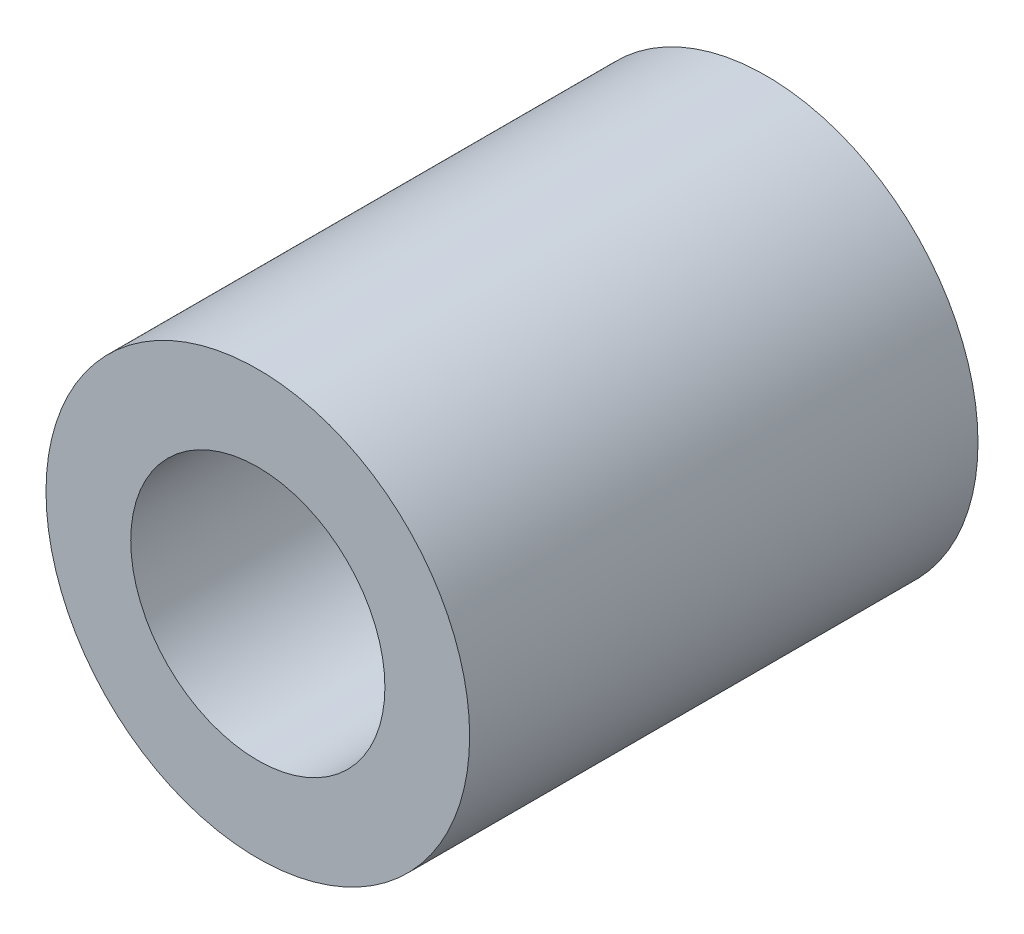
ISO-10303-21;
HEADER;
FILE_DESCRIPTION(('STEP AP214'),'2;1');
FILE_NAME('part.step','',(''),(''),'','','');
FILE_SCHEMA(('AUTOMOTIVE_DESIGN { 1 0 10303 214 1 1 1 1 }'));
ENDSEC;
DATA;
#1=APPLICATION_CONTEXT('core data for automotive mechanical design processes');
#2=APPLICATION_PROTOCOL_DEFINITION('international standard','automotive_design',2000,#1);
#3=PRODUCT_CONTEXT('',#1,'mechanical');
#4=PRODUCT('Part','Part','',(#3));
#5=PRODUCT_RELATED_PRODUCT_CATEGORY('part','',(#4));
#6=PRODUCT_DEFINITION_FORMATION('','',#4);
#7=PRODUCT_DEFINITION_CONTEXT('part definition',#1,'design');
#8=PRODUCT_DEFINITION('design','',#6,#7);
#9=PRODUCT_DEFINITION_SHAPE('','',#8);
#10=(LENGTH_UNIT() NAMED_UNIT(*) SI_UNIT(.MILLI.,.METRE.));
#11=(NAMED_UNIT(*) PLANE_ANGLE_UNIT() SI_UNIT($,.RADIAN.));
#12=(NAMED_UNIT(*) SI_UNIT($,.STERADIAN.) SOLID_ANGLE_UNIT());
#13=UNCERTAINTY_MEASURE_WITH_UNIT(LENGTH_MEASURE(1.E-05),#10,'distance_accuracy_value','');
#14=(GEOMETRIC_REPRESENTATION_CONTEXT(3) GLOBAL_UNCERTAINTY_ASSIGNED_CONTEXT((#13)) GLOBAL_UNIT_ASSIGNED_CONTEXT((#10,
#11,#12)) REPRESENTATION_CONTEXT('',''));
#15=CARTESIAN_POINT('',(0.,0.,0.));
#16=DIRECTION('',(0.,0.,1.));
#17=DIRECTION('',(1.,0.,0.));
#18=AXIS2_PLACEMENT_3D('',#15,#16,#17);
#19=CARTESIAN_POINT('',(0.,0.,12.));
#20=DIRECTION('',(0.,0.,1.));
#21=DIRECTION('',(1.,0.,0.));
#22=AXIS2_PLACEMENT_3D('',#19,#20,#21);
#23=PLANE('',#22);
#24=CARTESIAN_POINT('',(0.,0.,12.));
#25=DIRECTION('',(0.,0.,1.));
#26=DIRECTION('',(1.,0.,0.));
#27=AXIS2_PLACEMENT_3D('',#24,#25,#26);
#28=CIRCLE('',#27,5.);
#29=CARTESIAN_POINT('',(5.,0.,12.));
#30=VERTEX_POINT('',#29);
#31=EDGE_CURVE('E10',#30,#30,#28,.T.);
#32=ORIENTED_EDGE('',*,*,#31,.T.);
#33=EDGE_LOOP('',(#32));
#34=FACE_BOUND('',#33,.T.);
#35=CARTESIAN_POINT('',(0.,0.,12.));
#36=DIRECTION('',(0.,0.,1.));
#37=DIRECTION('',(1.,0.,0.));
#38=AXIS2_PLACEMENT_3D('',#35,#36,#37);
#39=CIRCLE('',#38,3.);
#40=CARTESIAN_POINT('',(3.,0.,12.));
#41=VERTEX_POINT('',#40);
#42=EDGE_CURVE('E42',#41,#41,#39,.T.);
#43=ORIENTED_EDGE('',*,*,#42,.F.);
#44=EDGE_LOOP('',(#43));
#45=FACE_BOUND('',#44,.T.);
#46=ADVANCED_FACE('F31',(#34,#45),#23,.T.);
#47=CARTESIAN_POINT('',(0.,0.,0.));
#48=DIRECTION('',(0.,0.,1.));
#49=DIRECTION('',(1.,0.,0.));
#50=AXIS2_PLACEMENT_3D('',#47,#48,#49);
#51=PLANE('',#50);
#52=CARTESIAN_POINT('',(0.,0.,0.));
#53=DIRECTION('',(0.,0.,1.));
#54=DIRECTION('',(1.,0.,0.));
#55=AXIS2_PLACEMENT_3D('',#52,#53,#54);
#56=CIRCLE('',#55,5.);
#57=CARTESIAN_POINT('',(5.,0.,0.));
#58=VERTEX_POINT('',#57);
#59=EDGE_CURVE('E35',#58,#58,#56,.T.);
#60=ORIENTED_EDGE('',*,*,#59,.F.);
#61=EDGE_LOOP('',(#60));
#62=FACE_BOUND('',#61,.T.);
#63=CARTESIAN_POINT('',(0.,0.,0.));
#64=DIRECTION('',(0.,0.,1.));
#65=DIRECTION('',(1.,0.,0.));
#66=AXIS2_PLACEMENT_3D('',#63,#64,#65);
#67=CIRCLE('',#66,3.);
#68=CARTESIAN_POINT('',(3.,0.,0.));
#69=VERTEX_POINT('',#68);
#70=EDGE_CURVE('E44',#69,#69,#67,.T.);
#71=ORIENTED_EDGE('',*,*,#70,.T.);
#72=EDGE_LOOP('',(#71));
#73=FACE_BOUND('',#72,.T.);
#74=ADVANCED_FACE('F54',(#62,#73),#51,.F.);
#75=CARTESIAN_POINT('',(0.,0.,12.));
#76=DIRECTION('',(0.,0.,-1.));
#77=DIRECTION('',(-1.,0.,0.));
#78=AXIS2_PLACEMENT_3D('',#75,#76,#77);
#79=CYLINDRICAL_SURFACE('',#78,5.);
#80=ORIENTED_EDGE('',*,*,#31,.F.);
#81=EDGE_LOOP('',(#80));
#82=FACE_BOUND('',#81,.T.);
#83=ORIENTED_EDGE('',*,*,#59,.T.);
#84=EDGE_LOOP('',(#83));
#85=FACE_BOUND('',#84,.T.);
#86=ADVANCED_FACE('F33',(#82,#85),#79,.T.);
#87=CARTESIAN_POINT('',(0.,0.,12.));
#88=DIRECTION('',(0.,0.,-1.));
#89=DIRECTION('',(-1.,0.,0.));
#90=AXIS2_PLACEMENT_3D('',#87,#88,#89);
#91=CYLINDRICAL_SURFACE('',#90,3.);
#92=ORIENTED_EDGE('',*,*,#42,.T.);
#93=EDGE_LOOP('',(#92));
#94=FACE_BOUND('',#93,.T.);
#95=ORIENTED_EDGE('',*,*,#70,.F.);
#96=EDGE_LOOP('',(#95));
#97=FACE_BOUND('',#96,.T.);
#98=ADVANCED_FACE('F50',(#94,#97),#91,.F.);
#99=CLOSED_SHELL('',(#46,#74,#86,#98));
#100=MANIFOLD_SOLID_BREP('B2',#99);
#101=ADVANCED_BREP_SHAPE_REPRESENTATION('',(#18,#100),#14);
#102=SHAPE_DEFINITION_REPRESENTATION(#9,#101);
ENDSEC;
END-ISO-10303-21;
